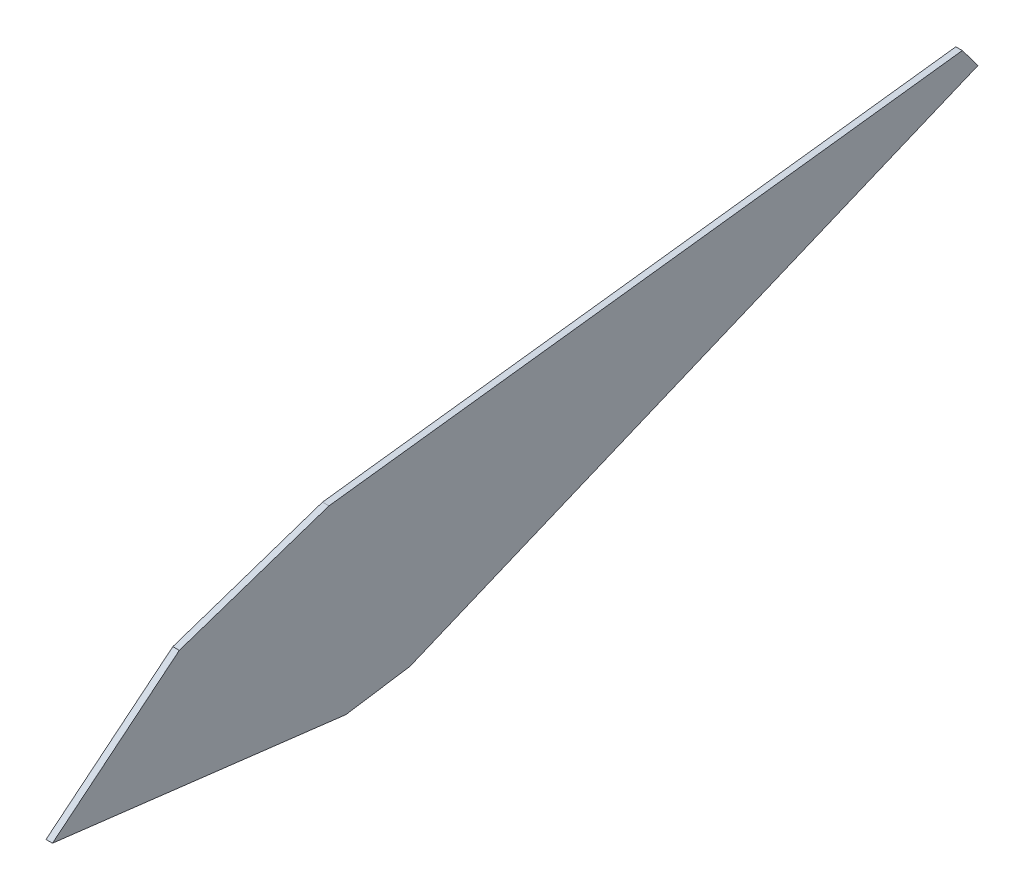
ISO-10303-21;
HEADER;
FILE_DESCRIPTION(('STEP AP214'),'2;1');
FILE_NAME('part.step','',(''),(''),'','','');
FILE_SCHEMA(('AUTOMOTIVE_DESIGN { 1 0 10303 214 1 1 1 1 }'));
ENDSEC;
DATA;
#1=APPLICATION_CONTEXT('core data for automotive mechanical design processes');
#2=APPLICATION_PROTOCOL_DEFINITION('international standard','automotive_design',2000,#1);
#3=PRODUCT_CONTEXT('',#1,'mechanical');
#4=PRODUCT('Part','Part','',(#3));
#5=PRODUCT_RELATED_PRODUCT_CATEGORY('part','',(#4));
#6=PRODUCT_DEFINITION_FORMATION('','',#4);
#7=PRODUCT_DEFINITION_CONTEXT('part definition',#1,'design');
#8=PRODUCT_DEFINITION('design','',#6,#7);
#9=PRODUCT_DEFINITION_SHAPE('','',#8);
#10=(LENGTH_UNIT() NAMED_UNIT(*) SI_UNIT(.MILLI.,.METRE.));
#11=(NAMED_UNIT(*) PLANE_ANGLE_UNIT() SI_UNIT($,.RADIAN.));
#12=(NAMED_UNIT(*) SI_UNIT($,.STERADIAN.) SOLID_ANGLE_UNIT());
#13=UNCERTAINTY_MEASURE_WITH_UNIT(LENGTH_MEASURE(1.E-05),#10,'distance_accuracy_value','');
#14=(GEOMETRIC_REPRESENTATION_CONTEXT(3) GLOBAL_UNCERTAINTY_ASSIGNED_CONTEXT((#13)) GLOBAL_UNIT_ASSIGNED_CONTEXT((#10,
#11,#12)) REPRESENTATION_CONTEXT('',''));
#15=CARTESIAN_POINT('',(0.,0.,0.));
#16=DIRECTION('',(0.,0.,1.));
#17=DIRECTION('',(1.,0.,0.));
#18=AXIS2_PLACEMENT_3D('',#15,#16,#17);
#19=CARTESIAN_POINT('',(0.635,-17.46504,30.30982));
#20=DIRECTION('',(0.,0.923267357697167,0.384158022447652));
#21=DIRECTION('',(0.,-0.384158022447652,0.923267357697168));
#22=AXIS2_PLACEMENT_3D('',#19,#20,#21);
#23=PLANE('',#22);
#24=DIRECTION('',(0.,0.384158022447652,-0.923267357697168));
#25=VECTOR('',#24,1.);
#26=CARTESIAN_POINT('',(0.,-17.46504,30.30982));
#27=LINE('',#26,#25);
#28=CARTESIAN_POINT('',(0.,-17.46504,30.30982));
#29=VERTEX_POINT('',#28);
#30=CARTESIAN_POINT('',(0.,5.715,-25.4));
#31=VERTEX_POINT('',#30);
#32=EDGE_CURVE('E123',#29,#31,#27,.T.);
#33=ORIENTED_EDGE('',*,*,#32,.T.);
#34=DIRECTION('',(-1.,0.,0.));
#35=VECTOR('',#34,1.);
#36=CARTESIAN_POINT('',(0.635,5.715,-25.4));
#37=LINE('',#36,#35);
#38=CARTESIAN_POINT('',(0.635,5.715,-25.4));
#39=VERTEX_POINT('',#38);
#40=EDGE_CURVE('E11',#39,#31,#37,.T.);
#41=ORIENTED_EDGE('',*,*,#40,.F.);
#42=DIRECTION('',(0.,0.384158022447652,-0.923267357697168));
#43=VECTOR('',#42,1.);
#44=CARTESIAN_POINT('',(0.635,-17.46504,30.30982));
#45=LINE('',#44,#43);
#46=CARTESIAN_POINT('',(0.635,-17.46504,30.30982));
#47=VERTEX_POINT('',#46);
#48=EDGE_CURVE('E135',#47,#39,#45,.T.);
#49=ORIENTED_EDGE('',*,*,#48,.F.);
#50=DIRECTION('',(-1.,0.,0.));
#51=VECTOR('',#50,1.);
#52=CARTESIAN_POINT('',(0.635,-17.46504,30.30982));
#53=LINE('',#52,#51);
#54=EDGE_CURVE('E119',#47,#29,#53,.T.);
#55=ORIENTED_EDGE('',*,*,#54,.T.);
#56=EDGE_LOOP('',(#33,#41,#49,#55));
#57=FACE_BOUND('',#56,.T.);
#58=ADVANCED_FACE('F33',(#57),#23,.F.);
#59=CARTESIAN_POINT('',(0.635,5.715,-25.4));
#60=DIRECTION('',(0.,-0.601905322033391,0.798567456955191));
#61=DIRECTION('',(0.,-0.798567456955191,-0.601905322033391));
#62=AXIS2_PLACEMENT_3D('',#59,#60,#61);
#63=PLANE('',#62);
#64=DIRECTION('',(0.,0.798567456955191,0.601905322033391));
#65=VECTOR('',#64,1.);
#66=CARTESIAN_POINT('',(0.,5.715,-25.4));
#67=LINE('',#66,#65);
#68=CARTESIAN_POINT('',(0.,7.75716,-23.86076));
#69=VERTEX_POINT('',#68);
#70=EDGE_CURVE('E126',#31,#69,#67,.T.);
#71=ORIENTED_EDGE('',*,*,#70,.T.);
#72=DIRECTION('',(-1.,0.,0.));
#73=VECTOR('',#72,1.);
#74=CARTESIAN_POINT('',(0.635,7.75716,-23.86076));
#75=LINE('',#74,#73);
#76=CARTESIAN_POINT('',(0.635,7.75716,-23.86076));
#77=VERTEX_POINT('',#76);
#78=EDGE_CURVE('E41',#77,#69,#75,.T.);
#79=ORIENTED_EDGE('',*,*,#78,.F.);
#80=DIRECTION('',(0.,0.798567456955191,0.601905322033391));
#81=VECTOR('',#80,1.);
#82=CARTESIAN_POINT('',(0.635,5.715,-25.4));
#83=LINE('',#82,#81);
#84=EDGE_CURVE('E89',#39,#77,#83,.T.);
#85=ORIENTED_EDGE('',*,*,#84,.F.);
#86=ORIENTED_EDGE('',*,*,#40,.T.);
#87=EDGE_LOOP('',(#71,#79,#85,#86));
#88=FACE_BOUND('',#87,.T.);
#89=ADVANCED_FACE('F160',(#88),#63,.F.);
#90=CARTESIAN_POINT('',(0.635,7.75716,-23.86076));
#91=DIRECTION('',(0.,-0.992563085406152,-0.121731349655791));
#92=DIRECTION('',(0.,0.121731349655791,-0.992563085406152));
#93=AXIS2_PLACEMENT_3D('',#90,#91,#92);
#94=PLANE('',#93);
#95=DIRECTION('',(0.,-0.121731349655791,0.992563085406152));
#96=VECTOR('',#95,1.);
#97=CARTESIAN_POINT('',(0.,7.75716,-23.86076));
#98=LINE('',#97,#96);
#99=CARTESIAN_POINT('',(0.,0.1397,38.24986));
#100=VERTEX_POINT('',#99);
#101=EDGE_CURVE('E128',#69,#100,#98,.T.);
#102=ORIENTED_EDGE('',*,*,#101,.T.);
#103=DIRECTION('',(-1.,0.,0.));
#104=VECTOR('',#103,1.);
#105=CARTESIAN_POINT('',(0.635,0.1397,38.24986));
#106=LINE('',#105,#104);
#107=CARTESIAN_POINT('',(0.635,0.1397,38.24986));
#108=VERTEX_POINT('',#107);
#109=EDGE_CURVE('E139',#108,#100,#106,.T.);
#110=ORIENTED_EDGE('',*,*,#109,.F.);
#111=DIRECTION('',(0.,-0.121731349655791,0.992563085406152));
#112=VECTOR('',#111,1.);
#113=CARTESIAN_POINT('',(0.635,7.75716,-23.86076));
#114=LINE('',#113,#112);
#115=EDGE_CURVE('E147',#77,#108,#114,.T.);
#116=ORIENTED_EDGE('',*,*,#115,.F.);
#117=ORIENTED_EDGE('',*,*,#78,.T.);
#118=EDGE_LOOP('',(#102,#110,#116,#117));
#119=FACE_BOUND('',#118,.T.);
#120=ADVANCED_FACE('F145',(#119),#94,.F.);
#121=CARTESIAN_POINT('',(0.635,0.1397,38.24986));
#122=DIRECTION('',(0.,-0.947876671886927,-0.318637434857491));
#123=DIRECTION('',(0.,0.318637434857491,-0.947876671886927));
#124=AXIS2_PLACEMENT_3D('',#121,#122,#123);
#125=PLANE('',#124);
#126=DIRECTION('',(0.,-0.318637434857491,0.947876671886928));
#127=VECTOR('',#126,1.);
#128=CARTESIAN_POINT('',(0.,0.1397,38.24986));
#129=LINE('',#128,#127);
#130=CARTESIAN_POINT('',(0.,-4.79552,52.93106));
#131=VERTEX_POINT('',#130);
#132=EDGE_CURVE('E130',#100,#131,#129,.T.);
#133=ORIENTED_EDGE('',*,*,#132,.T.);
#134=DIRECTION('',(-1.,0.,0.));
#135=VECTOR('',#134,1.);
#136=CARTESIAN_POINT('',(0.635,-4.79552,52.93106));
#137=LINE('',#136,#135);
#138=CARTESIAN_POINT('',(0.635,-4.79552,52.93106));
#139=VERTEX_POINT('',#138);
#140=EDGE_CURVE('E114',#139,#131,#137,.T.);
#141=ORIENTED_EDGE('',*,*,#140,.F.);
#142=DIRECTION('',(0.,-0.318637434857491,0.947876671886928));
#143=VECTOR('',#142,1.);
#144=CARTESIAN_POINT('',(0.635,0.1397,38.24986));
#145=LINE('',#144,#143);
#146=EDGE_CURVE('E105',#108,#139,#145,.T.);
#147=ORIENTED_EDGE('',*,*,#146,.F.);
#148=ORIENTED_EDGE('',*,*,#109,.T.);
#149=EDGE_LOOP('',(#133,#141,#147,#148));
#150=FACE_BOUND('',#149,.T.);
#151=ADVANCED_FACE('F153',(#150),#125,.F.);
#152=CARTESIAN_POINT('',(0.635,-4.79552,52.93106));
#153=DIRECTION('',(0.,-0.77447143004225,-0.632608887108229));
#154=DIRECTION('',(0.,0.632608887108229,-0.77447143004225));
#155=AXIS2_PLACEMENT_3D('',#152,#153,#154);
#156=PLANE('',#155);
#157=DIRECTION('',(0.,-0.632608887108229,0.77447143004225));
#158=VECTOR('',#157,1.);
#159=CARTESIAN_POINT('',(0.,-4.79552,52.93106));
#160=LINE('',#159,#158);
#161=CARTESIAN_POINT('',(0.,-14.95552,65.36944));
#162=VERTEX_POINT('',#161);
#163=EDGE_CURVE('E113',#131,#162,#160,.T.);
#164=ORIENTED_EDGE('',*,*,#163,.T.);
#165=DIRECTION('',(-1.,0.,0.));
#166=VECTOR('',#165,1.);
#167=CARTESIAN_POINT('',(0.635,-14.95552,65.36944));
#168=LINE('',#167,#166);
#169=CARTESIAN_POINT('',(0.635,-14.95552,65.36944));
#170=VERTEX_POINT('',#169);
#171=EDGE_CURVE('E110',#170,#162,#168,.T.);
#172=ORIENTED_EDGE('',*,*,#171,.F.);
#173=DIRECTION('',(0.,-0.632608887108229,0.77447143004225));
#174=VECTOR('',#173,1.);
#175=CARTESIAN_POINT('',(0.635,-4.79552,52.93106));
#176=LINE('',#175,#174);
#177=EDGE_CURVE('E99',#139,#170,#176,.T.);
#178=ORIENTED_EDGE('',*,*,#177,.F.);
#179=ORIENTED_EDGE('',*,*,#140,.T.);
#180=EDGE_LOOP('',(#164,#172,#178,#179));
#181=FACE_BOUND('',#180,.T.);
#182=ADVANCED_FACE('F111',(#181),#156,.F.);
#183=CARTESIAN_POINT('',(0.635,-14.95552,65.36944));
#184=DIRECTION('',(0.,0.992823258998328,-0.11959087085534));
#185=DIRECTION('',(0.,0.11959087085534,0.992823258998328));
#186=AXIS2_PLACEMENT_3D('',#183,#184,#185);
#187=PLANE('',#186);
#188=DIRECTION('',(0.,-0.11959087085534,-0.992823258998328));
#189=VECTOR('',#188,1.);
#190=CARTESIAN_POINT('',(0.,-14.95552,65.36944));
#191=LINE('',#190,#189);
#192=CARTESIAN_POINT('',(0.,-18.42262,36.58616));
#193=VERTEX_POINT('',#192);
#194=EDGE_CURVE('E75',#162,#193,#191,.T.);
#195=ORIENTED_EDGE('',*,*,#194,.T.);
#196=DIRECTION('',(-1.,0.,0.));
#197=VECTOR('',#196,1.);
#198=CARTESIAN_POINT('',(0.635,-18.42262,36.58616));
#199=LINE('',#198,#197);
#200=CARTESIAN_POINT('',(0.635,-18.42262,36.58616));
#201=VERTEX_POINT('',#200);
#202=EDGE_CURVE('E115',#201,#193,#199,.T.);
#203=ORIENTED_EDGE('',*,*,#202,.F.);
#204=DIRECTION('',(0.,-0.11959087085534,-0.992823258998328));
#205=VECTOR('',#204,1.);
#206=CARTESIAN_POINT('',(0.635,-14.95552,65.36944));
#207=LINE('',#206,#205);
#208=EDGE_CURVE('E103',#170,#201,#207,.T.);
#209=ORIENTED_EDGE('',*,*,#208,.F.);
#210=ORIENTED_EDGE('',*,*,#171,.T.);
#211=EDGE_LOOP('',(#195,#203,#209,#210));
#212=FACE_BOUND('',#211,.T.);
#213=ADVANCED_FACE('F117',(#212),#187,.F.);
#214=CARTESIAN_POINT('',(0.635,-18.42262,36.58616));
#215=DIRECTION('',(0.,0.988560555272323,0.15082449588736));
#216=DIRECTION('',(0.,-0.15082449588736,0.988560555272323));
#217=AXIS2_PLACEMENT_3D('',#214,#215,#216);
#218=PLANE('',#217);
#219=DIRECTION('',(0.,0.15082449588736,-0.988560555272323));
#220=VECTOR('',#219,1.);
#221=CARTESIAN_POINT('',(0.,-18.42262,36.58616));
#222=LINE('',#221,#220);
#223=EDGE_CURVE('E81',#193,#29,#222,.T.);
#224=ORIENTED_EDGE('',*,*,#223,.T.);
#225=ORIENTED_EDGE('',*,*,#54,.F.);
#226=DIRECTION('',(0.,0.15082449588736,-0.988560555272323));
#227=VECTOR('',#226,1.);
#228=CARTESIAN_POINT('',(0.635,-18.42262,36.58616));
#229=LINE('',#228,#227);
#230=EDGE_CURVE('E49',#201,#47,#229,.T.);
#231=ORIENTED_EDGE('',*,*,#230,.F.);
#232=ORIENTED_EDGE('',*,*,#202,.T.);
#233=EDGE_LOOP('',(#224,#225,#231,#232));
#234=FACE_BOUND('',#233,.T.);
#235=ADVANCED_FACE('F174',(#234),#218,.F.);
#236=CARTESIAN_POINT('',(0.635,0.,0.));
#237=DIRECTION('',(1.,0.,0.));
#238=DIRECTION('',(0.,0.,-1.));
#239=AXIS2_PLACEMENT_3D('',#236,#237,#238);
#240=PLANE('',#239);
#241=ORIENTED_EDGE('',*,*,#48,.T.);
#242=ORIENTED_EDGE('',*,*,#84,.T.);
#243=ORIENTED_EDGE('',*,*,#115,.T.);
#244=ORIENTED_EDGE('',*,*,#146,.T.);
#245=ORIENTED_EDGE('',*,*,#177,.T.);
#246=ORIENTED_EDGE('',*,*,#208,.T.);
#247=ORIENTED_EDGE('',*,*,#230,.T.);
#248=EDGE_LOOP('',(#241,#242,#243,#244,#245,#246,#247));
#249=FACE_BOUND('',#248,.T.);
#250=ADVANCED_FACE('F101',(#249),#240,.T.);
#251=CARTESIAN_POINT('',(0.,0.,0.));
#252=DIRECTION('',(1.,0.,0.));
#253=DIRECTION('',(0.,0.,-1.));
#254=AXIS2_PLACEMENT_3D('',#251,#252,#253);
#255=PLANE('',#254);
#256=ORIENTED_EDGE('',*,*,#32,.F.);
#257=ORIENTED_EDGE('',*,*,#223,.F.);
#258=ORIENTED_EDGE('',*,*,#194,.F.);
#259=ORIENTED_EDGE('',*,*,#163,.F.);
#260=ORIENTED_EDGE('',*,*,#132,.F.);
#261=ORIENTED_EDGE('',*,*,#101,.F.);
#262=ORIENTED_EDGE('',*,*,#70,.F.);
#263=EDGE_LOOP('',(#256,#257,#258,#259,#260,#261,#262));
#264=FACE_BOUND('',#263,.T.);
#265=ADVANCED_FACE('F151',(#264),#255,.F.);
#266=CLOSED_SHELL('',(#58,#89,#120,#151,#182,#213,#235,#250,#265));
#267=MANIFOLD_SOLID_BREP('B2',#266);
#268=ADVANCED_BREP_SHAPE_REPRESENTATION('',(#18,#267),#14);
#269=SHAPE_DEFINITION_REPRESENTATION(#9,#268);
ENDSEC;
END-ISO-10303-21;
